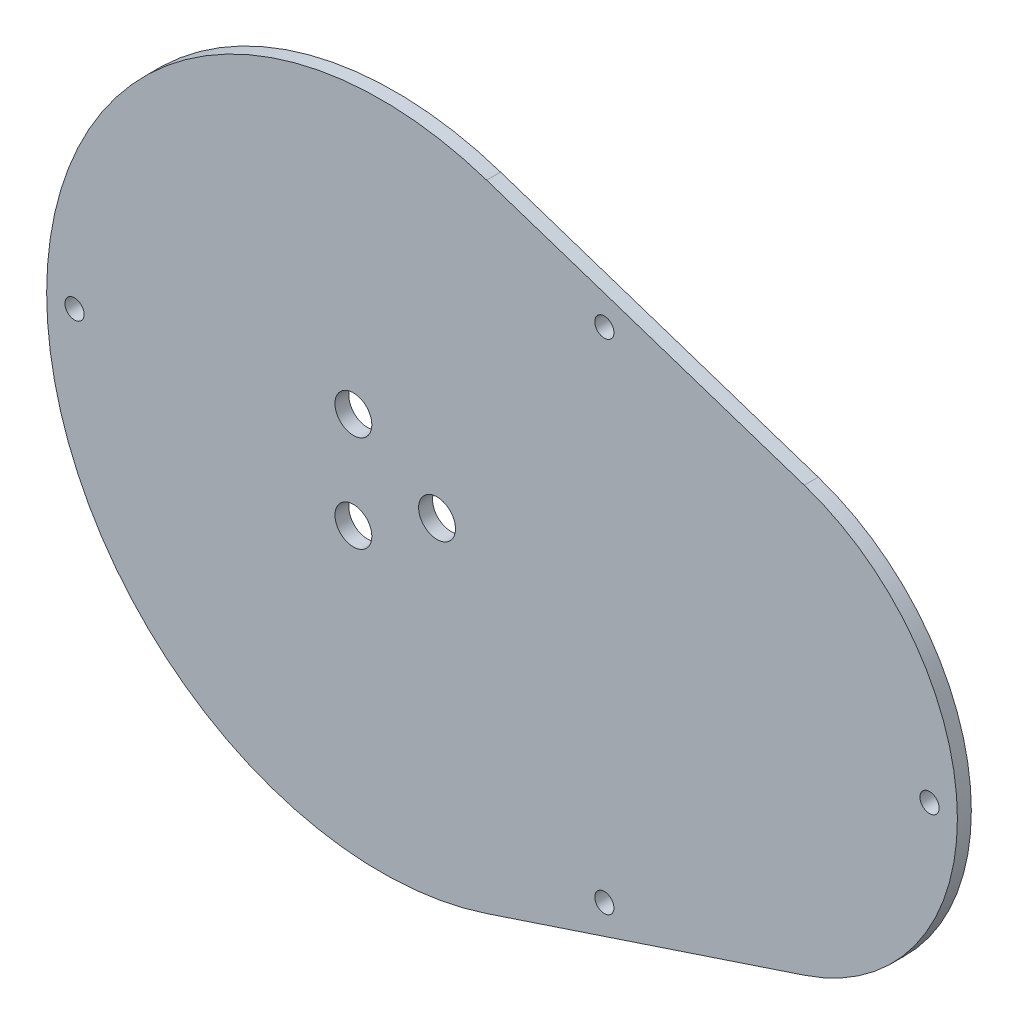
ISO-10303-21;
HEADER;
FILE_DESCRIPTION(('STEP AP214'),'2;1');
FILE_NAME('part.step','',(''),(''),'','','');
FILE_SCHEMA(('AUTOMOTIVE_DESIGN { 1 0 10303 214 1 1 1 1 }'));
ENDSEC;
DATA;
#1=APPLICATION_CONTEXT('core data for automotive mechanical design processes');
#2=APPLICATION_PROTOCOL_DEFINITION('international standard','automotive_design',2000,#1);
#3=PRODUCT_CONTEXT('',#1,'mechanical');
#4=PRODUCT('Part','Part','',(#3));
#5=PRODUCT_RELATED_PRODUCT_CATEGORY('part','',(#4));
#6=PRODUCT_DEFINITION_FORMATION('','',#4);
#7=PRODUCT_DEFINITION_CONTEXT('part definition',#1,'design');
#8=PRODUCT_DEFINITION('design','',#6,#7);
#9=PRODUCT_DEFINITION_SHAPE('','',#8);
#10=(LENGTH_UNIT() NAMED_UNIT(*) SI_UNIT(.MILLI.,.METRE.));
#11=(NAMED_UNIT(*) PLANE_ANGLE_UNIT() SI_UNIT($,.RADIAN.));
#12=(NAMED_UNIT(*) SI_UNIT($,.STERADIAN.) SOLID_ANGLE_UNIT());
#13=UNCERTAINTY_MEASURE_WITH_UNIT(LENGTH_MEASURE(1.E-05),#10,'distance_accuracy_value','');
#14=(GEOMETRIC_REPRESENTATION_CONTEXT(3) GLOBAL_UNCERTAINTY_ASSIGNED_CONTEXT((#13)) GLOBAL_UNIT_ASSIGNED_CONTEXT((#10,
#11,#12)) REPRESENTATION_CONTEXT('',''));
#15=CARTESIAN_POINT('',(0.,0.,0.));
#16=DIRECTION('',(0.,0.,1.));
#17=DIRECTION('',(1.,0.,0.));
#18=AXIS2_PLACEMENT_3D('',#15,#16,#17);
#19=CARTESIAN_POINT('',(0.,0.,1.5875));
#20=DIRECTION('',(0.,0.,1.));
#21=DIRECTION('',(1.,0.,0.));
#22=AXIS2_PLACEMENT_3D('',#19,#20,#21);
#23=PLANE('',#22);
#24=CARTESIAN_POINT('',(-3.175,-5.49926131403118,1.5875));
#25=DIRECTION('',(0.,0.,1.));
#26=DIRECTION('',(1.,0.,0.));
#27=AXIS2_PLACEMENT_3D('',#24,#25,#26);
#28=CIRCLE('',#27,2.1);
#29=CARTESIAN_POINT('',(-1.075,-5.49926131403118,1.5875));
#30=VERTEX_POINT('',#29);
#31=EDGE_CURVE('E141',#30,#30,#28,.T.);
#32=ORIENTED_EDGE('',*,*,#31,.F.);
#33=EDGE_LOOP('',(#32));
#34=FACE_BOUND('',#33,.T.);
#35=CARTESIAN_POINT('',(-34.925,0.,1.5875));
#36=DIRECTION('',(0.,0.,1.));
#37=DIRECTION('',(1.,0.,0.));
#38=AXIS2_PLACEMENT_3D('',#35,#36,#37);
#39=CIRCLE('',#38,1.0922);
#40=CARTESIAN_POINT('',(-33.8328,0.,1.5875));
#41=VERTEX_POINT('',#40);
#42=EDGE_CURVE('E129',#41,#41,#39,.T.);
#43=ORIENTED_EDGE('',*,*,#42,.F.);
#44=EDGE_LOOP('',(#43));
#45=FACE_BOUND('',#44,.T.);
#46=CARTESIAN_POINT('',(25.4,28.368817804248,1.5875));
#47=DIRECTION('',(0.,0.,1.));
#48=DIRECTION('',(1.,0.,0.));
#49=AXIS2_PLACEMENT_3D('',#46,#47,#48);
#50=CIRCLE('',#49,1.0922);
#51=CARTESIAN_POINT('',(26.4922,28.368817804248,1.5875));
#52=VERTEX_POINT('',#51);
#53=EDGE_CURVE('E117',#52,#52,#50,.T.);
#54=ORIENTED_EDGE('',*,*,#53,.F.);
#55=EDGE_LOOP('',(#54));
#56=FACE_BOUND('',#55,.T.);
#57=CARTESIAN_POINT('',(0.,0.,1.5875));
#58=DIRECTION('',(0.,0.,1.));
#59=DIRECTION('',(1.,0.,0.));
#60=AXIS2_PLACEMENT_3D('',#57,#58,#59);
#61=CIRCLE('',#60,38.1);
#62=CARTESIAN_POINT('',(12.000049197085,36.1608741496599,1.5875));
#63=VERTEX_POINT('',#62);
#64=CARTESIAN_POINT('',(12.000049197085,-36.1608741496599,1.5875));
#65=VERTEX_POINT('',#64);
#66=EDGE_CURVE('E87',#63,#65,#61,.T.);
#67=ORIENTED_EDGE('',*,*,#66,.T.);
#68=DIRECTION('',(0.949104308390023,0.314961921183334,0.));
#69=VECTOR('',#68,1.);
#70=CARTESIAN_POINT('',(12.000049197085,-36.1608741496599,1.5875));
#71=LINE('',#70,#69);
#72=CARTESIAN_POINT('',(48.1609233467449,-24.1608249525748,1.5875));
#73=VERTEX_POINT('',#72);
#74=EDGE_CURVE('E82',#65,#73,#71,.T.);
#75=ORIENTED_EDGE('',*,*,#74,.T.);
#76=CARTESIAN_POINT('',(40.1431114190489,0.,1.5875));
#77=DIRECTION('',(0.,0.,1.));
#78=DIRECTION('',(1.,0.,0.));
#79=AXIS2_PLACEMENT_3D('',#76,#77,#78);
#80=CIRCLE('',#79,25.4564485051797);
#81=CARTESIAN_POINT('',(48.1609233467449,24.1608249525748,1.5875));
#82=VERTEX_POINT('',#81);
#83=EDGE_CURVE('E85',#73,#82,#80,.T.);
#84=ORIENTED_EDGE('',*,*,#83,.T.);
#85=DIRECTION('',(-0.949104308390022,0.314961921183335,0.));
#86=VECTOR('',#85,1.);
#87=CARTESIAN_POINT('',(12.000049197085,36.1608741496599,1.5875));
#88=LINE('',#87,#86);
#89=EDGE_CURVE('E52',#82,#63,#88,.T.);
#90=ORIENTED_EDGE('',*,*,#89,.T.);
#91=EDGE_LOOP('',(#67,#75,#84,#90));
#92=FACE_BOUND('',#91,.T.);
#93=CARTESIAN_POINT('',(62.4245599242286,0.,1.5875));
#94=DIRECTION('',(0.,0.,1.));
#95=DIRECTION('',(1.,0.,0.));
#96=AXIS2_PLACEMENT_3D('',#93,#94,#95);
#97=CIRCLE('',#96,1.09219999999999);
#98=CARTESIAN_POINT('',(63.5167599242286,0.,1.5875));
#99=VERTEX_POINT('',#98);
#100=EDGE_CURVE('E102',#99,#99,#97,.T.);
#101=ORIENTED_EDGE('',*,*,#100,.F.);
#102=EDGE_LOOP('',(#101));
#103=FACE_BOUND('',#102,.T.);
#104=CARTESIAN_POINT('',(25.4,-28.3688178042479,1.5875));
#105=DIRECTION('',(0.,0.,1.));
#106=DIRECTION('',(1.,0.,0.));
#107=AXIS2_PLACEMENT_3D('',#104,#105,#106);
#108=CIRCLE('',#107,1.0922);
#109=CARTESIAN_POINT('',(26.4922,-28.3688178042479,1.5875));
#110=VERTEX_POINT('',#109);
#111=EDGE_CURVE('E123',#110,#110,#108,.T.);
#112=ORIENTED_EDGE('',*,*,#111,.F.);
#113=EDGE_LOOP('',(#112));
#114=FACE_BOUND('',#113,.T.);
#115=CARTESIAN_POINT('',(6.35,0.,1.5875));
#116=DIRECTION('',(0.,0.,1.));
#117=DIRECTION('',(1.,0.,0.));
#118=AXIS2_PLACEMENT_3D('',#115,#116,#117);
#119=CIRCLE('',#118,2.1);
#120=CARTESIAN_POINT('',(8.45,0.,1.5875));
#121=VERTEX_POINT('',#120);
#122=EDGE_CURVE('E135',#121,#121,#119,.T.);
#123=ORIENTED_EDGE('',*,*,#122,.F.);
#124=EDGE_LOOP('',(#123));
#125=FACE_BOUND('',#124,.T.);
#126=CARTESIAN_POINT('',(-3.175,5.49926131403119,1.5875));
#127=DIRECTION('',(0.,0.,1.));
#128=DIRECTION('',(1.,0.,0.));
#129=AXIS2_PLACEMENT_3D('',#126,#127,#128);
#130=CIRCLE('',#129,2.1);
#131=CARTESIAN_POINT('',(-1.075,5.49926131403119,1.5875));
#132=VERTEX_POINT('',#131);
#133=EDGE_CURVE('E147',#132,#132,#130,.T.);
#134=ORIENTED_EDGE('',*,*,#133,.F.);
#135=EDGE_LOOP('',(#134));
#136=FACE_BOUND('',#135,.T.);
#137=ADVANCED_FACE('F35',(#34,#45,#56,#92,#103,#114,#125,#136),#23,.T.);
#138=CARTESIAN_POINT('',(0.,0.,0.));
#139=DIRECTION('',(0.,0.,1.));
#140=DIRECTION('',(1.,0.,0.));
#141=AXIS2_PLACEMENT_3D('',#138,#139,#140);
#142=PLANE('',#141);
#143=CARTESIAN_POINT('',(-3.175,-5.49926131403118,0.));
#144=DIRECTION('',(0.,0.,1.));
#145=DIRECTION('',(1.,0.,0.));
#146=AXIS2_PLACEMENT_3D('',#143,#144,#145);
#147=CIRCLE('',#146,2.1);
#148=CARTESIAN_POINT('',(-1.075,-5.49926131403118,0.));
#149=VERTEX_POINT('',#148);
#150=EDGE_CURVE('E144',#149,#149,#147,.T.);
#151=ORIENTED_EDGE('',*,*,#150,.T.);
#152=EDGE_LOOP('',(#151));
#153=FACE_BOUND('',#152,.T.);
#154=CARTESIAN_POINT('',(-34.925,0.,0.));
#155=DIRECTION('',(0.,0.,1.));
#156=DIRECTION('',(1.,0.,0.));
#157=AXIS2_PLACEMENT_3D('',#154,#155,#156);
#158=CIRCLE('',#157,1.0922);
#159=CARTESIAN_POINT('',(-33.8328,0.,0.));
#160=VERTEX_POINT('',#159);
#161=EDGE_CURVE('E132',#160,#160,#158,.T.);
#162=ORIENTED_EDGE('',*,*,#161,.T.);
#163=EDGE_LOOP('',(#162));
#164=FACE_BOUND('',#163,.T.);
#165=CARTESIAN_POINT('',(25.4,28.368817804248,0.));
#166=DIRECTION('',(0.,0.,1.));
#167=DIRECTION('',(1.,0.,0.));
#168=AXIS2_PLACEMENT_3D('',#165,#166,#167);
#169=CIRCLE('',#168,1.0922);
#170=CARTESIAN_POINT('',(26.4922,28.368817804248,0.));
#171=VERTEX_POINT('',#170);
#172=EDGE_CURVE('E120',#171,#171,#169,.T.);
#173=ORIENTED_EDGE('',*,*,#172,.T.);
#174=EDGE_LOOP('',(#173));
#175=FACE_BOUND('',#174,.T.);
#176=CARTESIAN_POINT('',(0.,0.,0.));
#177=DIRECTION('',(0.,0.,1.));
#178=DIRECTION('',(1.,0.,0.));
#179=AXIS2_PLACEMENT_3D('',#176,#177,#178);
#180=CIRCLE('',#179,38.1);
#181=CARTESIAN_POINT('',(12.000049197085,36.1608741496599,0.));
#182=VERTEX_POINT('',#181);
#183=CARTESIAN_POINT('',(12.000049197085,-36.1608741496599,0.));
#184=VERTEX_POINT('',#183);
#185=EDGE_CURVE('E99',#182,#184,#180,.T.);
#186=ORIENTED_EDGE('',*,*,#185,.F.);
#187=DIRECTION('',(-0.949104308390022,0.314961921183335,0.));
#188=VECTOR('',#187,1.);
#189=CARTESIAN_POINT('',(12.000049197085,36.1608741496599,0.));
#190=LINE('',#189,#188);
#191=CARTESIAN_POINT('',(48.1609233467449,24.1608249525748,0.));
#192=VERTEX_POINT('',#191);
#193=EDGE_CURVE('E75',#192,#182,#190,.T.);
#194=ORIENTED_EDGE('',*,*,#193,.F.);
#195=CARTESIAN_POINT('',(40.1431114190489,0.,0.));
#196=DIRECTION('',(0.,0.,1.));
#197=DIRECTION('',(1.,0.,0.));
#198=AXIS2_PLACEMENT_3D('',#195,#196,#197);
#199=CIRCLE('',#198,25.4564485051797);
#200=CARTESIAN_POINT('',(48.1609233467449,-24.1608249525748,0.));
#201=VERTEX_POINT('',#200);
#202=EDGE_CURVE('E69',#201,#192,#199,.T.);
#203=ORIENTED_EDGE('',*,*,#202,.F.);
#204=DIRECTION('',(0.949104308390023,0.314961921183334,0.));
#205=VECTOR('',#204,1.);
#206=CARTESIAN_POINT('',(12.000049197085,-36.1608741496599,0.));
#207=LINE('',#206,#205);
#208=EDGE_CURVE('E91',#184,#201,#207,.T.);
#209=ORIENTED_EDGE('',*,*,#208,.F.);
#210=EDGE_LOOP('',(#186,#194,#203,#209));
#211=FACE_BOUND('',#210,.T.);
#212=CARTESIAN_POINT('',(62.4245599242286,0.,0.));
#213=DIRECTION('',(0.,0.,1.));
#214=DIRECTION('',(1.,0.,0.));
#215=AXIS2_PLACEMENT_3D('',#212,#213,#214);
#216=CIRCLE('',#215,1.09219999999999);
#217=CARTESIAN_POINT('',(63.5167599242286,0.,0.));
#218=VERTEX_POINT('',#217);
#219=EDGE_CURVE('E114',#218,#218,#216,.T.);
#220=ORIENTED_EDGE('',*,*,#219,.T.);
#221=EDGE_LOOP('',(#220));
#222=FACE_BOUND('',#221,.T.);
#223=CARTESIAN_POINT('',(25.4,-28.3688178042479,0.));
#224=DIRECTION('',(0.,0.,1.));
#225=DIRECTION('',(1.,0.,0.));
#226=AXIS2_PLACEMENT_3D('',#223,#224,#225);
#227=CIRCLE('',#226,1.0922);
#228=CARTESIAN_POINT('',(26.4922,-28.3688178042479,0.));
#229=VERTEX_POINT('',#228);
#230=EDGE_CURVE('E126',#229,#229,#227,.T.);
#231=ORIENTED_EDGE('',*,*,#230,.T.);
#232=EDGE_LOOP('',(#231));
#233=FACE_BOUND('',#232,.T.);
#234=CARTESIAN_POINT('',(6.35,0.,0.));
#235=DIRECTION('',(0.,0.,1.));
#236=DIRECTION('',(1.,0.,0.));
#237=AXIS2_PLACEMENT_3D('',#234,#235,#236);
#238=CIRCLE('',#237,2.1);
#239=CARTESIAN_POINT('',(8.45,0.,0.));
#240=VERTEX_POINT('',#239);
#241=EDGE_CURVE('E138',#240,#240,#238,.T.);
#242=ORIENTED_EDGE('',*,*,#241,.T.);
#243=EDGE_LOOP('',(#242));
#244=FACE_BOUND('',#243,.T.);
#245=CARTESIAN_POINT('',(-3.175,5.49926131403119,0.));
#246=DIRECTION('',(0.,0.,1.));
#247=DIRECTION('',(1.,0.,0.));
#248=AXIS2_PLACEMENT_3D('',#245,#246,#247);
#249=CIRCLE('',#248,2.1);
#250=CARTESIAN_POINT('',(-1.075,5.49926131403119,0.));
#251=VERTEX_POINT('',#250);
#252=EDGE_CURVE('E150',#251,#251,#249,.T.);
#253=ORIENTED_EDGE('',*,*,#252,.T.);
#254=EDGE_LOOP('',(#253));
#255=FACE_BOUND('',#254,.T.);
#256=ADVANCED_FACE('F110',(#153,#164,#175,#211,#222,#233,#244,#255),#142,.F.);
#257=CARTESIAN_POINT('',(0.,0.,1.5875));
#258=DIRECTION('',(0.,0.,-1.));
#259=DIRECTION('',(-1.,0.,0.));
#260=AXIS2_PLACEMENT_3D('',#257,#258,#259);
#261=CYLINDRICAL_SURFACE('',#260,38.1);
#262=ORIENTED_EDGE('',*,*,#185,.T.);
#263=DIRECTION('',(0.,0.,-1.));
#264=VECTOR('',#263,1.);
#265=CARTESIAN_POINT('',(12.000049197085,-36.1608741496599,1.5875));
#266=LINE('',#265,#264);
#267=EDGE_CURVE('E11',#65,#184,#266,.T.);
#268=ORIENTED_EDGE('',*,*,#267,.F.);
#269=ORIENTED_EDGE('',*,*,#66,.F.);
#270=DIRECTION('',(0.,0.,-1.));
#271=VECTOR('',#270,1.);
#272=CARTESIAN_POINT('',(12.000049197085,36.1608741496599,1.5875));
#273=LINE('',#272,#271);
#274=EDGE_CURVE('E95',#63,#182,#273,.T.);
#275=ORIENTED_EDGE('',*,*,#274,.T.);
#276=EDGE_LOOP('',(#262,#268,#269,#275));
#277=FACE_BOUND('',#276,.T.);
#278=ADVANCED_FACE('F37',(#277),#261,.T.);
#279=CARTESIAN_POINT('',(12.000049197085,-36.1608741496599,1.5875));
#280=DIRECTION('',(-0.314961921183334,0.949104308390023,0.));
#281=DIRECTION('',(-0.949104308390023,-0.314961921183334,0.));
#282=AXIS2_PLACEMENT_3D('',#279,#280,#281);
#283=PLANE('',#282);
#284=ORIENTED_EDGE('',*,*,#208,.T.);
#285=DIRECTION('',(0.,0.,-1.));
#286=VECTOR('',#285,1.);
#287=CARTESIAN_POINT('',(48.1609233467449,-24.1608249525748,1.5875));
#288=LINE('',#287,#286);
#289=EDGE_CURVE('E44',#73,#201,#288,.T.);
#290=ORIENTED_EDGE('',*,*,#289,.F.);
#291=ORIENTED_EDGE('',*,*,#74,.F.);
#292=ORIENTED_EDGE('',*,*,#267,.T.);
#293=EDGE_LOOP('',(#284,#290,#291,#292));
#294=FACE_BOUND('',#293,.T.);
#295=ADVANCED_FACE('F90',(#294),#283,.F.);
#296=CARTESIAN_POINT('',(40.1431114190489,0.,1.5875));
#297=DIRECTION('',(0.,0.,-1.));
#298=DIRECTION('',(-1.,0.,0.));
#299=AXIS2_PLACEMENT_3D('',#296,#297,#298);
#300=CYLINDRICAL_SURFACE('',#299,25.4564485051797);
#301=ORIENTED_EDGE('',*,*,#202,.T.);
#302=DIRECTION('',(0.,0.,-1.));
#303=VECTOR('',#302,1.);
#304=CARTESIAN_POINT('',(48.1609233467449,24.1608249525748,1.5875));
#305=LINE('',#304,#303);
#306=EDGE_CURVE('E92',#82,#192,#305,.T.);
#307=ORIENTED_EDGE('',*,*,#306,.F.);
#308=ORIENTED_EDGE('',*,*,#83,.F.);
#309=ORIENTED_EDGE('',*,*,#289,.T.);
#310=EDGE_LOOP('',(#301,#307,#308,#309));
#311=FACE_BOUND('',#310,.T.);
#312=ADVANCED_FACE('F93',(#311),#300,.T.);
#313=CARTESIAN_POINT('',(12.000049197085,36.1608741496599,1.5875));
#314=DIRECTION('',(-0.314961921183335,-0.949104308390022,0.));
#315=DIRECTION('',(0.949104308390023,-0.314961921183335,0.));
#316=AXIS2_PLACEMENT_3D('',#313,#314,#315);
#317=PLANE('',#316);
#318=ORIENTED_EDGE('',*,*,#193,.T.);
#319=ORIENTED_EDGE('',*,*,#274,.F.);
#320=ORIENTED_EDGE('',*,*,#89,.F.);
#321=ORIENTED_EDGE('',*,*,#306,.T.);
#322=EDGE_LOOP('',(#318,#319,#320,#321));
#323=FACE_BOUND('',#322,.T.);
#324=ADVANCED_FACE('F107',(#323),#317,.F.);
#325=CARTESIAN_POINT('',(62.4245599242286,0.,1.5875));
#326=DIRECTION('',(0.,0.,-1.));
#327=DIRECTION('',(-1.,0.,0.));
#328=AXIS2_PLACEMENT_3D('',#325,#326,#327);
#329=CYLINDRICAL_SURFACE('',#328,1.09219999999999);
#330=ORIENTED_EDGE('',*,*,#100,.T.);
#331=EDGE_LOOP('',(#330));
#332=FACE_BOUND('',#331,.T.);
#333=ORIENTED_EDGE('',*,*,#219,.F.);
#334=EDGE_LOOP('',(#333));
#335=FACE_BOUND('',#334,.T.);
#336=ADVANCED_FACE('F170',(#332,#335),#329,.F.);
#337=CARTESIAN_POINT('',(25.4,28.368817804248,1.5875));
#338=DIRECTION('',(0.,0.,-1.));
#339=DIRECTION('',(-1.,0.,0.));
#340=AXIS2_PLACEMENT_3D('',#337,#338,#339);
#341=CYLINDRICAL_SURFACE('',#340,1.0922);
#342=ORIENTED_EDGE('',*,*,#53,.T.);
#343=EDGE_LOOP('',(#342));
#344=FACE_BOUND('',#343,.T.);
#345=ORIENTED_EDGE('',*,*,#172,.F.);
#346=EDGE_LOOP('',(#345));
#347=FACE_BOUND('',#346,.T.);
#348=ADVANCED_FACE('F216',(#344,#347),#341,.F.);
#349=CARTESIAN_POINT('',(25.4,-28.3688178042479,1.5875));
#350=DIRECTION('',(0.,0.,-1.));
#351=DIRECTION('',(-1.,0.,0.));
#352=AXIS2_PLACEMENT_3D('',#349,#350,#351);
#353=CYLINDRICAL_SURFACE('',#352,1.0922);
#354=ORIENTED_EDGE('',*,*,#111,.T.);
#355=EDGE_LOOP('',(#354));
#356=FACE_BOUND('',#355,.T.);
#357=ORIENTED_EDGE('',*,*,#230,.F.);
#358=EDGE_LOOP('',(#357));
#359=FACE_BOUND('',#358,.T.);
#360=ADVANCED_FACE('F224',(#356,#359),#353,.F.);
#361=CARTESIAN_POINT('',(-34.925,0.,1.5875));
#362=DIRECTION('',(0.,0.,-1.));
#363=DIRECTION('',(-1.,0.,0.));
#364=AXIS2_PLACEMENT_3D('',#361,#362,#363);
#365=CYLINDRICAL_SURFACE('',#364,1.0922);
#366=ORIENTED_EDGE('',*,*,#42,.T.);
#367=EDGE_LOOP('',(#366));
#368=FACE_BOUND('',#367,.T.);
#369=ORIENTED_EDGE('',*,*,#161,.F.);
#370=EDGE_LOOP('',(#369));
#371=FACE_BOUND('',#370,.T.);
#372=ADVANCED_FACE('F232',(#368,#371),#365,.F.);
#373=CARTESIAN_POINT('',(6.35,0.,1.5875));
#374=DIRECTION('',(0.,0.,-1.));
#375=DIRECTION('',(-1.,0.,0.));
#376=AXIS2_PLACEMENT_3D('',#373,#374,#375);
#377=CYLINDRICAL_SURFACE('',#376,2.1);
#378=ORIENTED_EDGE('',*,*,#122,.T.);
#379=EDGE_LOOP('',(#378));
#380=FACE_BOUND('',#379,.T.);
#381=ORIENTED_EDGE('',*,*,#241,.F.);
#382=EDGE_LOOP('',(#381));
#383=FACE_BOUND('',#382,.T.);
#384=ADVANCED_FACE('F241',(#380,#383),#377,.F.);
#385=CARTESIAN_POINT('',(-3.175,-5.49926131403118,1.5875));
#386=DIRECTION('',(0.,0.,-1.));
#387=DIRECTION('',(-1.,0.,0.));
#388=AXIS2_PLACEMENT_3D('',#385,#386,#387);
#389=CYLINDRICAL_SURFACE('',#388,2.1);
#390=ORIENTED_EDGE('',*,*,#31,.T.);
#391=EDGE_LOOP('',(#390));
#392=FACE_BOUND('',#391,.T.);
#393=ORIENTED_EDGE('',*,*,#150,.F.);
#394=EDGE_LOOP('',(#393));
#395=FACE_BOUND('',#394,.T.);
#396=ADVANCED_FACE('F250',(#392,#395),#389,.F.);
#397=CARTESIAN_POINT('',(-3.175,5.49926131403119,1.5875));
#398=DIRECTION('',(0.,0.,-1.));
#399=DIRECTION('',(-1.,0.,0.));
#400=AXIS2_PLACEMENT_3D('',#397,#398,#399);
#401=CYLINDRICAL_SURFACE('',#400,2.1);
#402=ORIENTED_EDGE('',*,*,#133,.T.);
#403=EDGE_LOOP('',(#402));
#404=FACE_BOUND('',#403,.T.);
#405=ORIENTED_EDGE('',*,*,#252,.F.);
#406=EDGE_LOOP('',(#405));
#407=FACE_BOUND('',#406,.T.);
#408=ADVANCED_FACE('F156',(#404,#407),#401,.F.);
#409=CLOSED_SHELL('',(#137,#256,#278,#295,#312,#324,#336,#348,#360,#372,#384,#396,#408));
#410=MANIFOLD_SOLID_BREP('B2',#409);
#411=ADVANCED_BREP_SHAPE_REPRESENTATION('',(#18,#410),#14);
#412=SHAPE_DEFINITION_REPRESENTATION(#9,#411);
ENDSEC;
END-ISO-10303-21;
